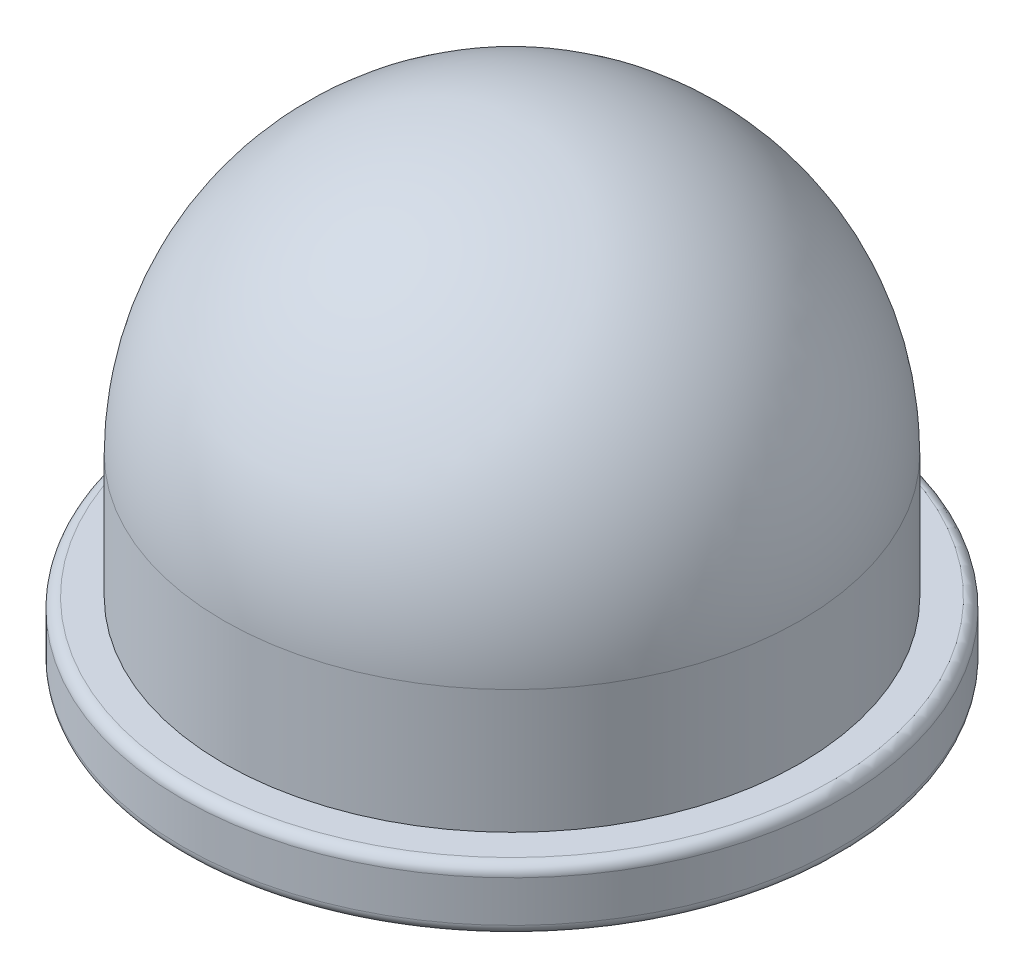
ISO-10303-21;
HEADER;
FILE_DESCRIPTION(('STEP AP214'),'2;1');
FILE_NAME('part.step','',(''),(''),'','','');
FILE_SCHEMA(('AUTOMOTIVE_DESIGN { 1 0 10303 214 1 1 1 1 }'));
ENDSEC;
DATA;
#1=APPLICATION_CONTEXT('core data for automotive mechanical design processes');
#2=APPLICATION_PROTOCOL_DEFINITION('international standard','automotive_design',2000,#1);
#3=PRODUCT_CONTEXT('',#1,'mechanical');
#4=PRODUCT('Part','Part','',(#3));
#5=PRODUCT_RELATED_PRODUCT_CATEGORY('part','',(#4));
#6=PRODUCT_DEFINITION_FORMATION('','',#4);
#7=PRODUCT_DEFINITION_CONTEXT('part definition',#1,'design');
#8=PRODUCT_DEFINITION('design','',#6,#7);
#9=PRODUCT_DEFINITION_SHAPE('','',#8);
#10=(LENGTH_UNIT() NAMED_UNIT(*) SI_UNIT(.MILLI.,.METRE.));
#11=(NAMED_UNIT(*) PLANE_ANGLE_UNIT() SI_UNIT($,.RADIAN.));
#12=(NAMED_UNIT(*) SI_UNIT($,.STERADIAN.) SOLID_ANGLE_UNIT());
#13=UNCERTAINTY_MEASURE_WITH_UNIT(LENGTH_MEASURE(1.E-05),#10,'distance_accuracy_value','');
#14=(GEOMETRIC_REPRESENTATION_CONTEXT(3) GLOBAL_UNCERTAINTY_ASSIGNED_CONTEXT((#13)) GLOBAL_UNIT_ASSIGNED_CONTEXT((#10,
#11,#12)) REPRESENTATION_CONTEXT('',''));
#15=CARTESIAN_POINT('',(0.,0.,0.));
#16=DIRECTION('',(0.,0.,1.));
#17=DIRECTION('',(1.,0.,0.));
#18=AXIS2_PLACEMENT_3D('',#15,#16,#17);
#19=CARTESIAN_POINT('',(0.,10.,0.));
#20=DIRECTION('',(0.,-1.,0.));
#21=DIRECTION('',(0.,0.,-1.));
#22=AXIS2_PLACEMENT_3D('',#19,#20,#21);
#23=CYLINDRICAL_SURFACE('',#22,7.);
#24=CARTESIAN_POINT('',(0.,3.,0.));
#25=DIRECTION('',(0.,-1.,0.));
#26=DIRECTION('',(0.,0.,-1.));
#27=AXIS2_PLACEMENT_3D('',#24,#25,#26);
#28=CIRCLE('',#27,7.);
#29=CARTESIAN_POINT('',(0.,3.,-7.));
#30=VERTEX_POINT('',#29);
#31=EDGE_CURVE('E50',#30,#30,#28,.T.);
#32=ORIENTED_EDGE('',*,*,#31,.T.);
#33=EDGE_LOOP('',(#32));
#34=FACE_BOUND('',#33,.T.);
#35=CARTESIAN_POINT('',(0.,0.,0.));
#36=DIRECTION('',(0.,-1.,0.));
#37=DIRECTION('',(0.,0.,-1.));
#38=AXIS2_PLACEMENT_3D('',#35,#36,#37);
#39=CIRCLE('',#38,7.);
#40=CARTESIAN_POINT('',(0.,0.,-7.));
#41=VERTEX_POINT('',#40);
#42=EDGE_CURVE('E53',#41,#41,#39,.T.);
#43=ORIENTED_EDGE('',*,*,#42,.F.);
#44=EDGE_LOOP('',(#43));
#45=FACE_BOUND('',#44,.T.);
#46=ADVANCED_FACE('F30',(#34,#45),#23,.T.);
#47=CARTESIAN_POINT('',(0.,0.,0.));
#48=DIRECTION('',(0.,-1.,0.));
#49=DIRECTION('',(0.,0.,-1.));
#50=AXIS2_PLACEMENT_3D('',#47,#48,#49);
#51=PLANE('',#50);
#52=CARTESIAN_POINT('',(0.,0.,0.));
#53=DIRECTION('',(0.,-1.,0.));
#54=DIRECTION('',(0.,0.,-1.));
#55=AXIS2_PLACEMENT_3D('',#52,#53,#54);
#56=CIRCLE('',#55,7.75);
#57=CARTESIAN_POINT('',(0.,0.,-7.75));
#58=VERTEX_POINT('',#57);
#59=EDGE_CURVE('E10',#58,#58,#56,.F.);
#60=ORIENTED_EDGE('',*,*,#59,.T.);
#61=EDGE_LOOP('',(#60));
#62=FACE_BOUND('',#61,.T.);
#63=ORIENTED_EDGE('',*,*,#42,.T.);
#64=EDGE_LOOP('',(#63));
#65=FACE_BOUND('',#64,.T.);
#66=ADVANCED_FACE('F83',(#62,#65),#51,.F.);
#67=CARTESIAN_POINT('',(0.,-1.5,0.));
#68=DIRECTION('',(0.,1.,0.));
#69=DIRECTION('',(0.,0.,1.));
#70=AXIS2_PLACEMENT_3D('',#67,#68,#69);
#71=CYLINDRICAL_SURFACE('',#70,8.);
#72=CARTESIAN_POINT('',(0.,-1.25,0.));
#73=DIRECTION('',(0.,-1.,0.));
#74=DIRECTION('',(0.,0.,-1.));
#75=AXIS2_PLACEMENT_3D('',#72,#73,#74);
#76=CIRCLE('',#75,8.);
#77=CARTESIAN_POINT('',(0.,-1.25,-8.));
#78=VERTEX_POINT('',#77);
#79=EDGE_CURVE('E37',#78,#78,#76,.F.);
#80=ORIENTED_EDGE('',*,*,#79,.T.);
#81=EDGE_LOOP('',(#80));
#82=FACE_BOUND('',#81,.T.);
#83=CARTESIAN_POINT('',(0.,-0.25,0.));
#84=DIRECTION('',(0.,-1.,0.));
#85=DIRECTION('',(0.,0.,-1.));
#86=AXIS2_PLACEMENT_3D('',#83,#84,#85);
#87=CIRCLE('',#86,8.);
#88=CARTESIAN_POINT('',(0.,-0.25,-8.));
#89=VERTEX_POINT('',#88);
#90=EDGE_CURVE('E41',#89,#89,#87,.T.);
#91=ORIENTED_EDGE('',*,*,#90,.T.);
#92=EDGE_LOOP('',(#91));
#93=FACE_BOUND('',#92,.T.);
#94=ADVANCED_FACE('F74',(#82,#93),#71,.T.);
#95=CARTESIAN_POINT('',(0.,-1.5,0.));
#96=DIRECTION('',(0.,-1.,0.));
#97=DIRECTION('',(0.,0.,-1.));
#98=AXIS2_PLACEMENT_3D('',#95,#96,#97);
#99=PLANE('',#98);
#100=CARTESIAN_POINT('',(0.,-1.5,0.));
#101=DIRECTION('',(0.,-1.,0.));
#102=DIRECTION('',(0.,0.,-1.));
#103=AXIS2_PLACEMENT_3D('',#100,#101,#102);
#104=CIRCLE('',#103,7.75);
#105=CARTESIAN_POINT('',(0.,-1.5,-7.75));
#106=VERTEX_POINT('',#105);
#107=EDGE_CURVE('E45',#106,#106,#104,.T.);
#108=ORIENTED_EDGE('',*,*,#107,.T.);
#109=EDGE_LOOP('',(#108));
#110=FACE_BOUND('',#109,.T.);
#111=CARTESIAN_POINT('',(0.,-1.5,0.));
#112=DIRECTION('',(0.,-1.,0.));
#113=DIRECTION('',(0.,0.,-1.));
#114=AXIS2_PLACEMENT_3D('',#111,#112,#113);
#115=CIRCLE('',#114,5.5);
#116=CARTESIAN_POINT('',(0.,-1.5,-5.5));
#117=VERTEX_POINT('',#116);
#118=EDGE_CURVE('E57',#117,#117,#115,.T.);
#119=ORIENTED_EDGE('',*,*,#118,.F.);
#120=EDGE_LOOP('',(#119));
#121=FACE_BOUND('',#120,.T.);
#122=ADVANCED_FACE('F72',(#110,#121),#99,.T.);
#123=CARTESIAN_POINT('',(0.,3.,0.));
#124=DIRECTION('',(0.,0.,1.));
#125=DIRECTION('',(1.,0.,0.));
#126=AXIS2_PLACEMENT_3D('',#123,#124,#125);
#127=SPHERICAL_SURFACE('',#126,7.);
#128=CARTESIAN_POINT('',(0.,3.,0.));
#129=DIRECTION('',(0.,-1.,0.));
#130=DIRECTION('',(0.,0.,-1.));
#131=AXIS2_PLACEMENT_3D('',#128,#129,#130);
#132=SPHERICAL_SURFACE('',#131,7.);
#133=ORIENTED_EDGE('',*,*,#31,.F.);
#134=EDGE_LOOP('',(#133));
#135=FACE_BOUND('',#134,.T.);
#136=ADVANCED_FACE('F68',(#135),#132,.T.);
#137=CARTESIAN_POINT('',(0.,10.,0.));
#138=DIRECTION('',(0.,-1.,0.));
#139=DIRECTION('',(0.,0.,-1.));
#140=AXIS2_PLACEMENT_3D('',#137,#138,#139);
#141=CYLINDRICAL_SURFACE('',#140,5.5);
#142=CARTESIAN_POINT('',(0.,3.,0.));
#143=DIRECTION('',(0.,-1.,0.));
#144=DIRECTION('',(0.,0.,-1.));
#145=AXIS2_PLACEMENT_3D('',#142,#143,#144);
#146=CIRCLE('',#145,5.5);
#147=CARTESIAN_POINT('',(0.,3.,-5.5));
#148=VERTEX_POINT('',#147);
#149=EDGE_CURVE('E56',#148,#148,#146,.T.);
#150=ORIENTED_EDGE('',*,*,#149,.F.);
#151=EDGE_LOOP('',(#150));
#152=FACE_BOUND('',#151,.T.);
#153=ORIENTED_EDGE('',*,*,#118,.T.);
#154=EDGE_LOOP('',(#153));
#155=FACE_BOUND('',#154,.T.);
#156=ADVANCED_FACE('F65',(#152,#155),#141,.F.);
#157=CARTESIAN_POINT('',(0.,3.,0.));
#158=DIRECTION('',(0.,0.,1.));
#159=DIRECTION('',(1.,0.,0.));
#160=AXIS2_PLACEMENT_3D('',#157,#158,#159);
#161=SPHERICAL_SURFACE('',#160,5.5);
#162=CARTESIAN_POINT('',(0.,3.,0.));
#163=DIRECTION('',(0.,-1.,0.));
#164=DIRECTION('',(0.,0.,-1.));
#165=AXIS2_PLACEMENT_3D('',#162,#163,#164);
#166=SPHERICAL_SURFACE('',#165,5.5);
#167=ORIENTED_EDGE('',*,*,#149,.T.);
#168=EDGE_LOOP('',(#167));
#169=FACE_BOUND('',#168,.T.);
#170=ADVANCED_FACE('F63',(#169),#166,.F.);
#171=CARTESIAN_POINT('',(0.,-1.25,0.));
#172=DIRECTION('',(0.,-1.,0.));
#173=DIRECTION('',(0.,0.,-1.));
#174=AXIS2_PLACEMENT_3D('',#171,#172,#173);
#175=TOROIDAL_SURFACE('',#174,7.75,0.25);
#176=ORIENTED_EDGE('',*,*,#79,.F.);
#177=EDGE_LOOP('',(#176));
#178=FACE_BOUND('',#177,.T.);
#179=ORIENTED_EDGE('',*,*,#107,.F.);
#180=EDGE_LOOP('',(#179));
#181=FACE_BOUND('',#180,.T.);
#182=ADVANCED_FACE('F94',(#178,#181),#175,.T.);
#183=CARTESIAN_POINT('',(0.,-0.25,0.));
#184=DIRECTION('',(0.,-1.,0.));
#185=DIRECTION('',(0.,0.,-1.));
#186=AXIS2_PLACEMENT_3D('',#183,#184,#185);
#187=TOROIDAL_SURFACE('',#186,7.75,0.25);
#188=ORIENTED_EDGE('',*,*,#59,.F.);
#189=EDGE_LOOP('',(#188));
#190=FACE_BOUND('',#189,.T.);
#191=ORIENTED_EDGE('',*,*,#90,.F.);
#192=EDGE_LOOP('',(#191));
#193=FACE_BOUND('',#192,.T.);
#194=ADVANCED_FACE('F32',(#190,#193),#187,.T.);
#195=CLOSED_SHELL('',(#46,#66,#94,#122,#136,#156,#170,#182,#194));
#196=MANIFOLD_SOLID_BREP('B2',#195);
#197=ADVANCED_BREP_SHAPE_REPRESENTATION('',(#18,#196),#14);
#198=SHAPE_DEFINITION_REPRESENTATION(#9,#197);
ENDSEC;
END-ISO-10303-21;
